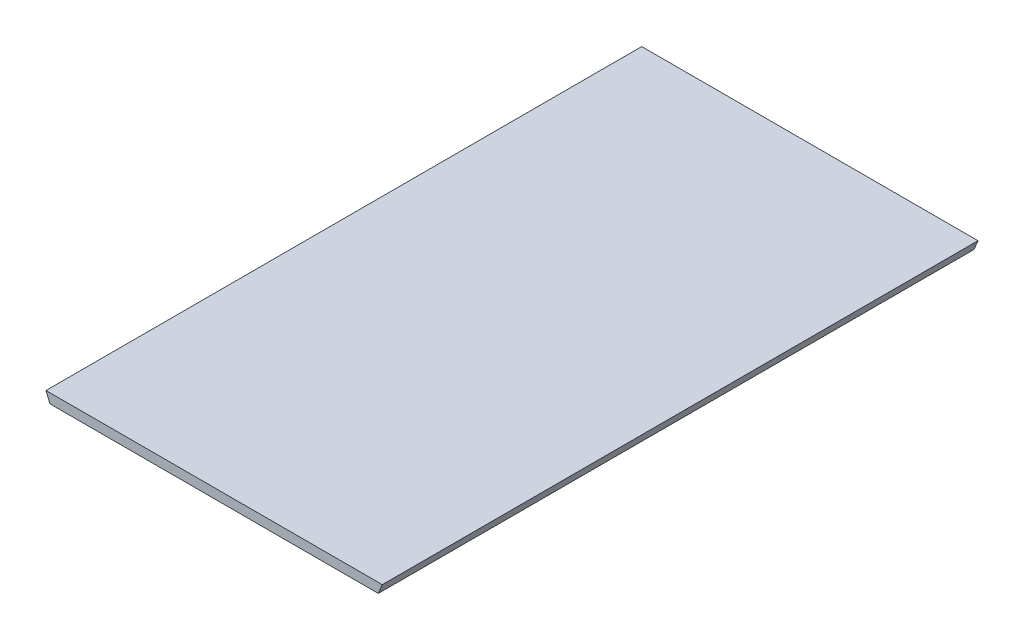
ISO-10303-21;
HEADER;
FILE_DESCRIPTION(('STEP AP214'),'2;1');
FILE_NAME('part.step','',(''),(''),'','','');
FILE_SCHEMA(('AUTOMOTIVE_DESIGN { 1 0 10303 214 1 1 1 1 }'));
ENDSEC;
DATA;
#1=APPLICATION_CONTEXT('core data for automotive mechanical design processes');
#2=APPLICATION_PROTOCOL_DEFINITION('international standard','automotive_design',2000,#1);
#3=PRODUCT_CONTEXT('',#1,'mechanical');
#4=PRODUCT('Part','Part','',(#3));
#5=PRODUCT_RELATED_PRODUCT_CATEGORY('part','',(#4));
#6=PRODUCT_DEFINITION_FORMATION('','',#4);
#7=PRODUCT_DEFINITION_CONTEXT('part definition',#1,'design');
#8=PRODUCT_DEFINITION('design','',#6,#7);
#9=PRODUCT_DEFINITION_SHAPE('','',#8);
#10=(LENGTH_UNIT() NAMED_UNIT(*) SI_UNIT(.MILLI.,.METRE.));
#11=(NAMED_UNIT(*) PLANE_ANGLE_UNIT() SI_UNIT($,.RADIAN.));
#12=(NAMED_UNIT(*) SI_UNIT($,.STERADIAN.) SOLID_ANGLE_UNIT());
#13=UNCERTAINTY_MEASURE_WITH_UNIT(LENGTH_MEASURE(1.E-05),#10,'distance_accuracy_value','');
#14=(GEOMETRIC_REPRESENTATION_CONTEXT(3) GLOBAL_UNCERTAINTY_ASSIGNED_CONTEXT((#13)) GLOBAL_UNIT_ASSIGNED_CONTEXT((#10,
#11,#12)) REPRESENTATION_CONTEXT('',''));
#15=CARTESIAN_POINT('',(0.,0.,0.));
#16=DIRECTION('',(0.,0.,1.));
#17=DIRECTION('',(1.,0.,0.));
#18=AXIS2_PLACEMENT_3D('',#15,#16,#17);
#19=CARTESIAN_POINT('',(0.,5.,0.));
#20=DIRECTION('',(0.,0.,-1.));
#21=DIRECTION('',(-1.,0.,0.));
#22=AXIS2_PLACEMENT_3D('',#19,#20,#21);
#23=PLANE('',#22);
#24=DIRECTION('',(1.,0.,0.));
#25=VECTOR('',#24,1.);
#26=CARTESIAN_POINT('',(0.,0.,0.));
#27=LINE('',#26,#25);
#28=CARTESIAN_POINT('',(0.,0.,0.));
#29=VERTEX_POINT('',#28);
#30=CARTESIAN_POINT('',(170.86,0.,0.));
#31=VERTEX_POINT('',#30);
#32=EDGE_CURVE('E56',#29,#31,#27,.T.);
#33=ORIENTED_EDGE('',*,*,#32,.T.);
#34=DIRECTION('',(-0.382515002167415,-0.923949280597622,0.));
#35=VECTOR('',#34,1.);
#36=CARTESIAN_POINT('',(172.93,4.99999999999998,0.));
#37=LINE('',#36,#35);
#38=CARTESIAN_POINT('',(172.93,4.99999999999998,0.));
#39=VERTEX_POINT('',#38);
#40=EDGE_CURVE('E76',#39,#31,#37,.T.);
#41=ORIENTED_EDGE('',*,*,#40,.F.);
#42=DIRECTION('',(1.,0.,0.));
#43=VECTOR('',#42,1.);
#44=CARTESIAN_POINT('',(0.,5.,0.));
#45=LINE('',#44,#43);
#46=CARTESIAN_POINT('',(-2.06999999999999,4.99999999999998,0.));
#47=VERTEX_POINT('',#46);
#48=EDGE_CURVE('E41',#47,#39,#45,.T.);
#49=ORIENTED_EDGE('',*,*,#48,.F.);
#50=DIRECTION('',(-0.382515002167415,0.923949280597622,0.));
#51=VECTOR('',#50,1.);
#52=CARTESIAN_POINT('',(0.,0.,0.));
#53=LINE('',#52,#51);
#54=EDGE_CURVE('E74',#29,#47,#53,.T.);
#55=ORIENTED_EDGE('',*,*,#54,.F.);
#56=EDGE_LOOP('',(#33,#41,#49,#55));
#57=FACE_BOUND('',#56,.T.);
#58=ADVANCED_FACE('F33',(#57),#23,.F.);
#59=CARTESIAN_POINT('',(0.,5.,-310.));
#60=DIRECTION('',(0.,0.,1.));
#61=DIRECTION('',(1.,0.,0.));
#62=AXIS2_PLACEMENT_3D('',#59,#60,#61);
#63=PLANE('',#62);
#64=DIRECTION('',(-1.,0.,0.));
#65=VECTOR('',#64,1.);
#66=CARTESIAN_POINT('',(0.,0.,-310.));
#67=LINE('',#66,#65);
#68=CARTESIAN_POINT('',(170.86,0.,-310.));
#69=VERTEX_POINT('',#68);
#70=CARTESIAN_POINT('',(0.,0.,-310.));
#71=VERTEX_POINT('',#70);
#72=EDGE_CURVE('E36',#69,#71,#67,.T.);
#73=ORIENTED_EDGE('',*,*,#72,.T.);
#74=DIRECTION('',(-0.382515002167415,0.923949280597622,0.));
#75=VECTOR('',#74,1.);
#76=CARTESIAN_POINT('',(0.,0.,-310.));
#77=LINE('',#76,#75);
#78=CARTESIAN_POINT('',(-2.06999999999999,4.99999999999998,-310.));
#79=VERTEX_POINT('',#78);
#80=EDGE_CURVE('E94',#71,#79,#77,.T.);
#81=ORIENTED_EDGE('',*,*,#80,.T.);
#82=DIRECTION('',(-1.,0.,0.));
#83=VECTOR('',#82,1.);
#84=CARTESIAN_POINT('',(0.,5.,-310.));
#85=LINE('',#84,#83);
#86=CARTESIAN_POINT('',(172.93,4.99999999999998,-310.));
#87=VERTEX_POINT('',#86);
#88=EDGE_CURVE('E11',#87,#79,#85,.T.);
#89=ORIENTED_EDGE('',*,*,#88,.F.);
#90=DIRECTION('',(-0.382515002167415,-0.923949280597622,0.));
#91=VECTOR('',#90,1.);
#92=CARTESIAN_POINT('',(172.93,4.99999999999998,-310.));
#93=LINE('',#92,#91);
#94=EDGE_CURVE('E91',#87,#69,#93,.T.);
#95=ORIENTED_EDGE('',*,*,#94,.T.);
#96=EDGE_LOOP('',(#73,#81,#89,#95));
#97=FACE_BOUND('',#96,.T.);
#98=ADVANCED_FACE('F106',(#97),#63,.F.);
#99=CARTESIAN_POINT('',(0.,5.,0.));
#100=DIRECTION('',(0.,-1.,0.));
#101=DIRECTION('',(0.,0.,-1.));
#102=AXIS2_PLACEMENT_3D('',#99,#100,#101);
#103=PLANE('',#102);
#104=ORIENTED_EDGE('',*,*,#88,.T.);
#105=DIRECTION('',(0.,0.,-1.));
#106=VECTOR('',#105,1.);
#107=CARTESIAN_POINT('',(-2.06999999999999,4.99999999999998,0.));
#108=LINE('',#107,#106);
#109=EDGE_CURVE('E82',#47,#79,#108,.T.);
#110=ORIENTED_EDGE('',*,*,#109,.F.);
#111=ORIENTED_EDGE('',*,*,#48,.T.);
#112=DIRECTION('',(0.,0.,-1.));
#113=VECTOR('',#112,1.);
#114=CARTESIAN_POINT('',(172.93,4.99999999999998,0.));
#115=LINE('',#114,#113);
#116=EDGE_CURVE('E86',#39,#87,#115,.T.);
#117=ORIENTED_EDGE('',*,*,#116,.T.);
#118=EDGE_LOOP('',(#104,#110,#111,#117));
#119=FACE_BOUND('',#118,.T.);
#120=ADVANCED_FACE('F83',(#119),#103,.F.);
#121=CARTESIAN_POINT('',(0.,0.,0.));
#122=DIRECTION('',(0.,-1.,0.));
#123=DIRECTION('',(0.,0.,-1.));
#124=AXIS2_PLACEMENT_3D('',#121,#122,#123);
#125=PLANE('',#124);
#126=DIRECTION('',(0.,0.,1.));
#127=VECTOR('',#126,1.);
#128=CARTESIAN_POINT('',(0.,0.,0.));
#129=LINE('',#128,#127);
#130=EDGE_CURVE('E90',#71,#29,#129,.T.);
#131=ORIENTED_EDGE('',*,*,#130,.F.);
#132=ORIENTED_EDGE('',*,*,#72,.F.);
#133=DIRECTION('',(0.,0.,-1.));
#134=VECTOR('',#133,1.);
#135=CARTESIAN_POINT('',(170.86,0.,0.));
#136=LINE('',#135,#134);
#137=EDGE_CURVE('E100',#31,#69,#136,.T.);
#138=ORIENTED_EDGE('',*,*,#137,.F.);
#139=ORIENTED_EDGE('',*,*,#32,.F.);
#140=EDGE_LOOP('',(#131,#132,#138,#139));
#141=FACE_BOUND('',#140,.T.);
#142=ADVANCED_FACE('F112',(#141),#125,.T.);
#143=CARTESIAN_POINT('',(172.93,4.99999999999998,0.));
#144=DIRECTION('',(0.923949280597622,-0.382515002167415,0.));
#145=DIRECTION('',(0.382515002167415,0.923949280597622,0.));
#146=AXIS2_PLACEMENT_3D('',#143,#144,#145);
#147=PLANE('',#146);
#148=ORIENTED_EDGE('',*,*,#94,.F.);
#149=ORIENTED_EDGE('',*,*,#116,.F.);
#150=ORIENTED_EDGE('',*,*,#40,.T.);
#151=ORIENTED_EDGE('',*,*,#137,.T.);
#152=EDGE_LOOP('',(#148,#149,#150,#151));
#153=FACE_BOUND('',#152,.T.);
#154=ADVANCED_FACE('F104',(#153),#147,.T.);
#155=CARTESIAN_POINT('',(0.,0.,0.));
#156=DIRECTION('',(-0.923949280597622,-0.382515002167415,0.));
#157=DIRECTION('',(0.382515002167415,-0.923949280597622,0.));
#158=AXIS2_PLACEMENT_3D('',#155,#156,#157);
#159=PLANE('',#158);
#160=ORIENTED_EDGE('',*,*,#80,.F.);
#161=ORIENTED_EDGE('',*,*,#130,.T.);
#162=ORIENTED_EDGE('',*,*,#54,.T.);
#163=ORIENTED_EDGE('',*,*,#109,.T.);
#164=EDGE_LOOP('',(#160,#161,#162,#163));
#165=FACE_BOUND('',#164,.T.);
#166=ADVANCED_FACE('F89',(#165),#159,.T.);
#167=CLOSED_SHELL('',(#58,#98,#120,#142,#154,#166));
#168=MANIFOLD_SOLID_BREP('B2',#167);
#169=ADVANCED_BREP_SHAPE_REPRESENTATION('',(#18,#168),#14);
#170=SHAPE_DEFINITION_REPRESENTATION(#9,#169);
ENDSEC;
END-ISO-10303-21;
